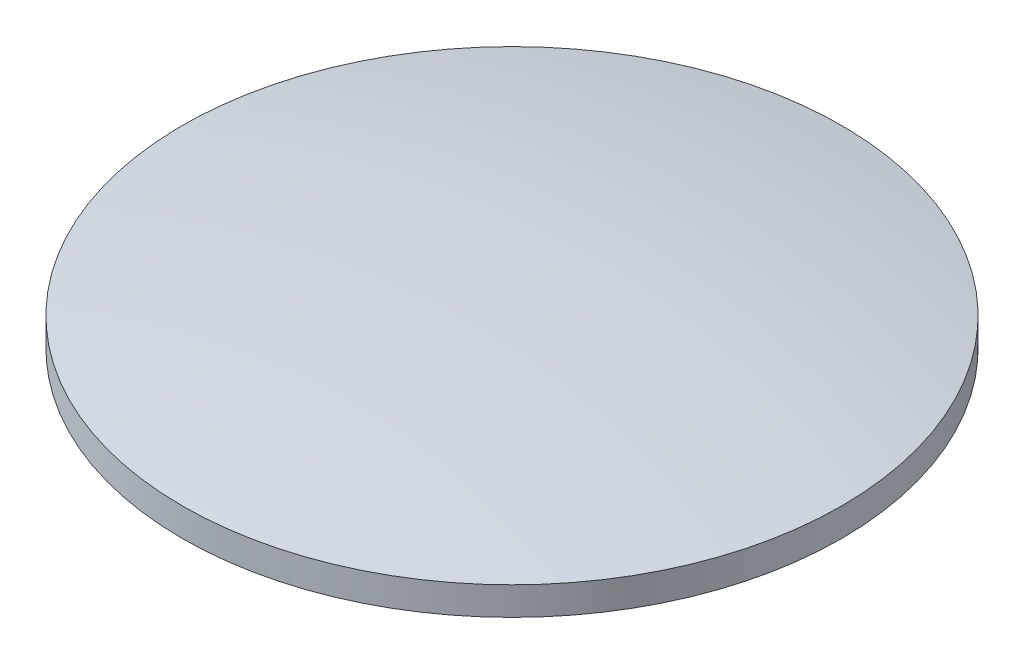
ISO-10303-21;
HEADER;
FILE_DESCRIPTION(('STEP AP214'),'2;1');
FILE_NAME('part.step','',(''),(''),'','','');
FILE_SCHEMA(('AUTOMOTIVE_DESIGN { 1 0 10303 214 1 1 1 1 }'));
ENDSEC;
DATA;
#1=APPLICATION_CONTEXT('core data for automotive mechanical design processes');
#2=APPLICATION_PROTOCOL_DEFINITION('international standard','automotive_design',2000,#1);
#3=PRODUCT_CONTEXT('',#1,'mechanical');
#4=PRODUCT('Part','Part','',(#3));
#5=PRODUCT_RELATED_PRODUCT_CATEGORY('part','',(#4));
#6=PRODUCT_DEFINITION_FORMATION('','',#4);
#7=PRODUCT_DEFINITION_CONTEXT('part definition',#1,'design');
#8=PRODUCT_DEFINITION('design','',#6,#7);
#9=PRODUCT_DEFINITION_SHAPE('','',#8);
#10=(LENGTH_UNIT() NAMED_UNIT(*) SI_UNIT(.MILLI.,.METRE.));
#11=(NAMED_UNIT(*) PLANE_ANGLE_UNIT() SI_UNIT($,.RADIAN.));
#12=(NAMED_UNIT(*) SI_UNIT($,.STERADIAN.) SOLID_ANGLE_UNIT());
#13=UNCERTAINTY_MEASURE_WITH_UNIT(LENGTH_MEASURE(1.E-05),#10,'distance_accuracy_value','');
#14=(GEOMETRIC_REPRESENTATION_CONTEXT(3) GLOBAL_UNCERTAINTY_ASSIGNED_CONTEXT((#13)) GLOBAL_UNIT_ASSIGNED_CONTEXT((#10,
#11,#12)) REPRESENTATION_CONTEXT('',''));
#15=CARTESIAN_POINT('',(0.,0.,0.));
#16=DIRECTION('',(0.,0.,1.));
#17=DIRECTION('',(1.,0.,0.));
#18=AXIS2_PLACEMENT_3D('',#15,#16,#17);
#19=CARTESIAN_POINT('',(0.,-171.75,0.));
#20=DIRECTION('',(0.,1.,0.));
#21=DIRECTION('',(1.,0.,0.));
#22=AXIS2_PLACEMENT_3D('',#19,#20,#21);
#23=SPHERICAL_SURFACE('',#22,176.75);
#24=CARTESIAN_POINT('',(0.,1.5,0.));
#25=DIRECTION('',(0.,1.,0.));
#26=DIRECTION('',(0.,0.,1.));
#27=AXIS2_PLACEMENT_3D('',#24,#25,#26);
#28=CIRCLE('',#27,35.);
#29=CARTESIAN_POINT('',(0.,1.5,35.));
#30=VERTEX_POINT('',#29);
#31=EDGE_CURVE('E10',#30,#30,#28,.T.);
#32=ORIENTED_EDGE('',*,*,#31,.T.);
#33=EDGE_LOOP('',(#32));
#34=FACE_BOUND('',#33,.T.);
#35=ADVANCED_FACE('F32',(#34),#23,.T.);
#36=CARTESIAN_POINT('',(0.,38.871213559322,0.));
#37=DIRECTION('',(0.,1.,0.));
#38=DIRECTION('',(0.,0.,1.));
#39=AXIS2_PLACEMENT_3D('',#36,#37,#38);
#40=CYLINDRICAL_SURFACE('',#39,35.);
#41=ORIENTED_EDGE('',*,*,#31,.F.);
#42=EDGE_LOOP('',(#41));
#43=FACE_BOUND('',#42,.T.);
#44=CARTESIAN_POINT('',(0.,-1.50000000000003,0.));
#45=DIRECTION('',(0.,1.,0.));
#46=DIRECTION('',(0.,0.,1.));
#47=AXIS2_PLACEMENT_3D('',#44,#45,#46);
#48=CIRCLE('',#47,34.9999999999999);
#49=CARTESIAN_POINT('',(0.,-1.50000000000003,34.9999999999999));
#50=VERTEX_POINT('',#49);
#51=EDGE_CURVE('E38',#50,#50,#48,.T.);
#52=ORIENTED_EDGE('',*,*,#51,.T.);
#53=EDGE_LOOP('',(#52));
#54=FACE_BOUND('',#53,.T.);
#55=ADVANCED_FACE('F44',(#43,#54),#40,.T.);
#56=CARTESIAN_POINT('',(0.,171.75,0.));
#57=DIRECTION('',(0.,1.,0.));
#58=DIRECTION('',(1.,0.,0.));
#59=AXIS2_PLACEMENT_3D('',#56,#57,#58);
#60=SPHERICAL_SURFACE('',#59,176.75);
#61=ORIENTED_EDGE('',*,*,#51,.F.);
#62=EDGE_LOOP('',(#61));
#63=FACE_BOUND('',#62,.T.);
#64=ADVANCED_FACE('F46',(#63),#60,.T.);
#65=CLOSED_SHELL('',(#35,#55,#64));
#66=MANIFOLD_SOLID_BREP('B2',#65);
#67=ADVANCED_BREP_SHAPE_REPRESENTATION('',(#18,#66),#14);
#68=SHAPE_DEFINITION_REPRESENTATION(#9,#67);
ENDSEC;
END-ISO-10303-21;
